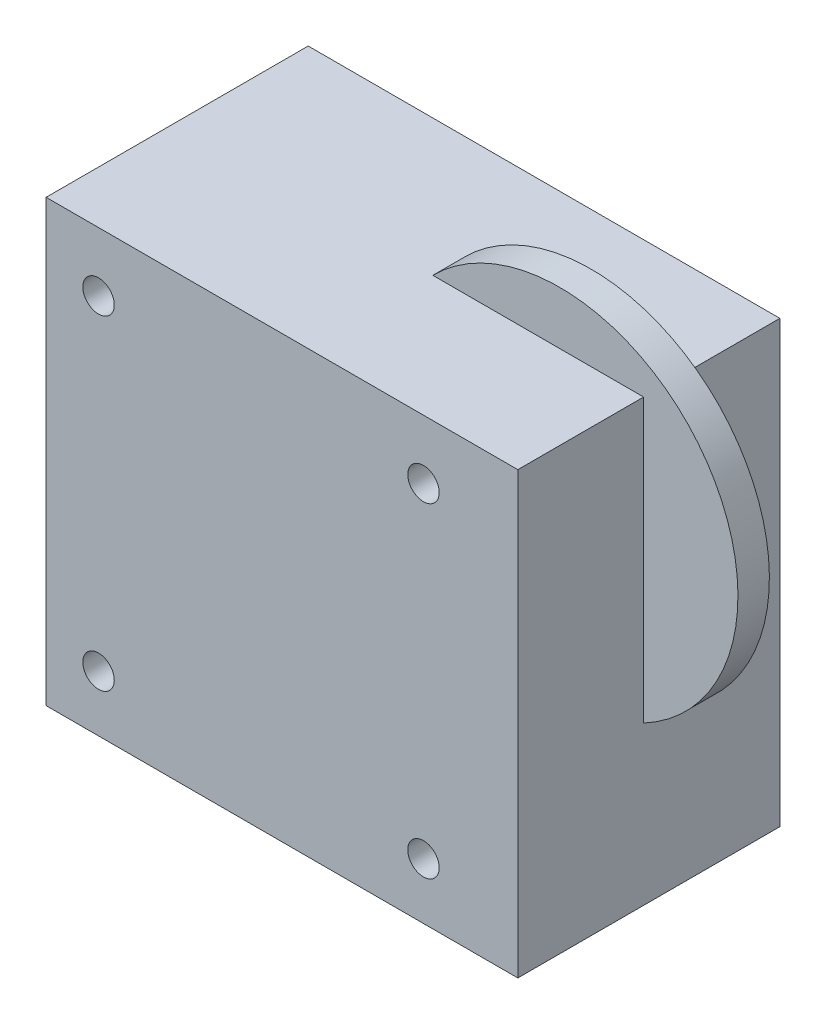
ISO-10303-21;
HEADER;
FILE_DESCRIPTION(('STEP AP214'),'2;1');
FILE_NAME('part.step','',(''),(''),'','','');
FILE_SCHEMA(('AUTOMOTIVE_DESIGN { 1 0 10303 214 1 1 1 1 }'));
ENDSEC;
DATA;
#1=APPLICATION_CONTEXT('core data for automotive mechanical design processes');
#2=APPLICATION_PROTOCOL_DEFINITION('international standard','automotive_design',2000,#1);
#3=PRODUCT_CONTEXT('',#1,'mechanical');
#4=PRODUCT('Part','Part','',(#3));
#5=PRODUCT_RELATED_PRODUCT_CATEGORY('part','',(#4));
#6=PRODUCT_DEFINITION_FORMATION('','',#4);
#7=PRODUCT_DEFINITION_CONTEXT('part definition',#1,'design');
#8=PRODUCT_DEFINITION('design','',#6,#7);
#9=PRODUCT_DEFINITION_SHAPE('','',#8);
#10=(LENGTH_UNIT() NAMED_UNIT(*) SI_UNIT(.MILLI.,.METRE.));
#11=(NAMED_UNIT(*) PLANE_ANGLE_UNIT() SI_UNIT($,.RADIAN.));
#12=(NAMED_UNIT(*) SI_UNIT($,.STERADIAN.) SOLID_ANGLE_UNIT());
#13=UNCERTAINTY_MEASURE_WITH_UNIT(LENGTH_MEASURE(1.E-05),#10,'distance_accuracy_value','');
#14=(GEOMETRIC_REPRESENTATION_CONTEXT(3) GLOBAL_UNCERTAINTY_ASSIGNED_CONTEXT((#13)) GLOBAL_UNIT_ASSIGNED_CONTEXT((#10,
#11,#12)) REPRESENTATION_CONTEXT('',''));
#15=CARTESIAN_POINT('',(0.,0.,0.));
#16=DIRECTION('',(0.,0.,1.));
#17=DIRECTION('',(1.,0.,0.));
#18=AXIS2_PLACEMENT_3D('',#15,#16,#17);
#19=CARTESIAN_POINT('',(13.5,15.35,0.));
#20=DIRECTION('',(0.,0.,1.));
#21=DIRECTION('',(1.,0.,0.));
#22=AXIS2_PLACEMENT_3D('',#19,#20,#21);
#23=CYLINDRICAL_SURFACE('',#22,1.5);
#24=CARTESIAN_POINT('',(13.5,15.35,0.));
#25=DIRECTION('',(0.,0.,1.));
#26=DIRECTION('',(1.,0.,0.));
#27=AXIS2_PLACEMENT_3D('',#24,#25,#26);
#28=CIRCLE('',#27,1.5);
#29=CARTESIAN_POINT('',(15.,15.35,0.));
#30=VERTEX_POINT('',#29);
#31=EDGE_CURVE('E152',#30,#30,#28,.T.);
#32=ORIENTED_EDGE('',*,*,#31,.F.);
#33=EDGE_LOOP('',(#32));
#34=FACE_BOUND('',#33,.T.);
#35=CARTESIAN_POINT('',(13.5,15.35,10.));
#36=DIRECTION('',(0.,0.,1.));
#37=DIRECTION('',(1.,0.,0.));
#38=AXIS2_PLACEMENT_3D('',#35,#36,#37);
#39=CIRCLE('',#38,1.5);
#40=CARTESIAN_POINT('',(15.,15.35,10.));
#41=VERTEX_POINT('',#40);
#42=EDGE_CURVE('E46',#41,#41,#39,.F.);
#43=ORIENTED_EDGE('',*,*,#42,.F.);
#44=EDGE_LOOP('',(#43));
#45=FACE_BOUND('',#44,.T.);
#46=ADVANCED_FACE('F37',(#34,#45),#23,.F.);
#47=CARTESIAN_POINT('',(22.5,-21.,25.));
#48=DIRECTION('',(-1.,0.,0.));
#49=DIRECTION('',(0.,0.,1.));
#50=AXIS2_PLACEMENT_3D('',#47,#48,#49);
#51=PLANE('',#50);
#52=DIRECTION('',(0.,0.,-1.));
#53=VECTOR('',#52,1.);
#54=CARTESIAN_POINT('',(22.5,-5.93560826022129,13.));
#55=LINE('',#54,#53);
#56=CARTESIAN_POINT('',(22.5,-5.93560826022129,13.));
#57=VERTEX_POINT('',#56);
#58=CARTESIAN_POINT('',(22.5,-5.93560826022129,10.));
#59=VERTEX_POINT('',#58);
#60=EDGE_CURVE('E53',#57,#59,#55,.T.);
#61=ORIENTED_EDGE('',*,*,#60,.F.);
#62=DIRECTION('',(0.,1.,0.));
#63=VECTOR('',#62,1.);
#64=CARTESIAN_POINT('',(22.5,-21.,13.));
#65=LINE('',#64,#63);
#66=CARTESIAN_POINT('',(22.5,21.,13.));
#67=VERTEX_POINT('',#66);
#68=EDGE_CURVE('E122',#57,#67,#65,.T.);
#69=ORIENTED_EDGE('',*,*,#68,.T.);
#70=DIRECTION('',(0.,0.,-1.));
#71=VECTOR('',#70,1.);
#72=CARTESIAN_POINT('',(22.5,21.,25.));
#73=LINE('',#72,#71);
#74=CARTESIAN_POINT('',(22.5,21.,25.));
#75=VERTEX_POINT('',#74);
#76=EDGE_CURVE('E198',#75,#67,#73,.T.);
#77=ORIENTED_EDGE('',*,*,#76,.F.);
#78=DIRECTION('',(0.,1.,0.));
#79=VECTOR('',#78,1.);
#80=CARTESIAN_POINT('',(22.5,-21.,25.));
#81=LINE('',#80,#79);
#82=CARTESIAN_POINT('',(22.5,-21.,25.));
#83=VERTEX_POINT('',#82);
#84=EDGE_CURVE('E160',#83,#75,#81,.T.);
#85=ORIENTED_EDGE('',*,*,#84,.F.);
#86=DIRECTION('',(0.,0.,-1.));
#87=VECTOR('',#86,1.);
#88=CARTESIAN_POINT('',(22.5,-21.,25.));
#89=LINE('',#88,#87);
#90=CARTESIAN_POINT('',(22.5,-21.,0.));
#91=VERTEX_POINT('',#90);
#92=EDGE_CURVE('E174',#83,#91,#89,.T.);
#93=ORIENTED_EDGE('',*,*,#92,.T.);
#94=DIRECTION('',(0.,1.,0.));
#95=VECTOR('',#94,1.);
#96=CARTESIAN_POINT('',(22.5,-21.,0.));
#97=LINE('',#96,#95);
#98=CARTESIAN_POINT('',(22.5,21.,0.));
#99=VERTEX_POINT('',#98);
#100=EDGE_CURVE('E156',#91,#99,#97,.T.);
#101=ORIENTED_EDGE('',*,*,#100,.T.);
#102=CARTESIAN_POINT('',(22.5,21.,10.));
#103=VERTEX_POINT('',#102);
#104=EDGE_CURVE('E197',#103,#99,#73,.T.);
#105=ORIENTED_EDGE('',*,*,#104,.F.);
#106=DIRECTION('',(0.,1.,0.));
#107=VECTOR('',#106,1.);
#108=CARTESIAN_POINT('',(22.5,-21.,10.));
#109=LINE('',#108,#107);
#110=EDGE_CURVE('E58',#59,#103,#109,.T.);
#111=ORIENTED_EDGE('',*,*,#110,.F.);
#112=EDGE_LOOP('',(#61,#69,#77,#85,#93,#101,#105,#111));
#113=FACE_BOUND('',#112,.T.);
#114=ADVANCED_FACE('F39',(#113),#51,.F.);
#115=CARTESIAN_POINT('',(-22.5,21.,25.));
#116=DIRECTION('',(0.,-1.,0.));
#117=DIRECTION('',(0.,0.,-1.));
#118=AXIS2_PLACEMENT_3D('',#115,#116,#117);
#119=PLANE('',#118);
#120=ORIENTED_EDGE('',*,*,#76,.T.);
#121=DIRECTION('',(-1.,0.,0.));
#122=VECTOR('',#121,1.);
#123=CARTESIAN_POINT('',(-22.5,21.,13.));
#124=LINE('',#123,#122);
#125=CARTESIAN_POINT('',(2.3945774357713,21.,13.));
#126=VERTEX_POINT('',#125);
#127=EDGE_CURVE('E99',#67,#126,#124,.T.);
#128=ORIENTED_EDGE('',*,*,#127,.T.);
#129=DIRECTION('',(0.,0.,-1.));
#130=VECTOR('',#129,1.);
#131=CARTESIAN_POINT('',(2.3945774357713,21.,13.));
#132=LINE('',#131,#130);
#133=CARTESIAN_POINT('',(2.3945774357713,21.,10.));
#134=VERTEX_POINT('',#133);
#135=EDGE_CURVE('E11',#134,#126,#132,.F.);
#136=ORIENTED_EDGE('',*,*,#135,.F.);
#137=DIRECTION('',(-1.,0.,0.));
#138=VECTOR('',#137,1.);
#139=CARTESIAN_POINT('',(-22.5,21.,10.));
#140=LINE('',#139,#138);
#141=EDGE_CURVE('E97',#103,#134,#140,.T.);
#142=ORIENTED_EDGE('',*,*,#141,.F.);
#143=ORIENTED_EDGE('',*,*,#104,.T.);
#144=DIRECTION('',(-1.,0.,0.));
#145=VECTOR('',#144,1.);
#146=CARTESIAN_POINT('',(-22.5,21.,0.));
#147=LINE('',#146,#145);
#148=CARTESIAN_POINT('',(-22.5,21.,0.));
#149=VERTEX_POINT('',#148);
#150=EDGE_CURVE('E178',#99,#149,#147,.T.);
#151=ORIENTED_EDGE('',*,*,#150,.T.);
#152=DIRECTION('',(0.,0.,-1.));
#153=VECTOR('',#152,1.);
#154=CARTESIAN_POINT('',(-22.5,21.,25.));
#155=LINE('',#154,#153);
#156=CARTESIAN_POINT('',(-22.5,21.,25.));
#157=VERTEX_POINT('',#156);
#158=EDGE_CURVE('E193',#157,#149,#155,.T.);
#159=ORIENTED_EDGE('',*,*,#158,.F.);
#160=DIRECTION('',(-1.,0.,0.));
#161=VECTOR('',#160,1.);
#162=CARTESIAN_POINT('',(-22.5,21.,25.));
#163=LINE('',#162,#161);
#164=EDGE_CURVE('E164',#75,#157,#163,.T.);
#165=ORIENTED_EDGE('',*,*,#164,.F.);
#166=EDGE_LOOP('',(#120,#128,#136,#142,#143,#151,#159,#165));
#167=FACE_BOUND('',#166,.T.);
#168=ADVANCED_FACE('F96',(#167),#119,.F.);
#169=CARTESIAN_POINT('',(-22.5,-21.,25.));
#170=DIRECTION('',(1.,0.,0.));
#171=DIRECTION('',(0.,0.,-1.));
#172=AXIS2_PLACEMENT_3D('',#169,#170,#171);
#173=PLANE('',#172);
#174=DIRECTION('',(0.,-1.,0.));
#175=VECTOR('',#174,1.);
#176=CARTESIAN_POINT('',(-22.5,-21.,0.));
#177=LINE('',#176,#175);
#178=CARTESIAN_POINT('',(-22.5,-21.,0.));
#179=VERTEX_POINT('',#178);
#180=EDGE_CURVE('E181',#149,#179,#177,.T.);
#181=ORIENTED_EDGE('',*,*,#180,.T.);
#182=DIRECTION('',(0.,0.,-1.));
#183=VECTOR('',#182,1.);
#184=CARTESIAN_POINT('',(-22.5,-21.,25.));
#185=LINE('',#184,#183);
#186=CARTESIAN_POINT('',(-22.5,-21.,25.));
#187=VERTEX_POINT('',#186);
#188=EDGE_CURVE('E189',#187,#179,#185,.T.);
#189=ORIENTED_EDGE('',*,*,#188,.F.);
#190=DIRECTION('',(0.,-1.,0.));
#191=VECTOR('',#190,1.);
#192=CARTESIAN_POINT('',(-22.5,-21.,25.));
#193=LINE('',#192,#191);
#194=EDGE_CURVE('E168',#157,#187,#193,.T.);
#195=ORIENTED_EDGE('',*,*,#194,.F.);
#196=ORIENTED_EDGE('',*,*,#158,.T.);
#197=EDGE_LOOP('',(#181,#189,#195,#196));
#198=FACE_BOUND('',#197,.T.);
#199=ADVANCED_FACE('F257',(#198),#173,.F.);
#200=CARTESIAN_POINT('',(-22.5,-21.,25.));
#201=DIRECTION('',(0.,1.,0.));
#202=DIRECTION('',(0.,0.,1.));
#203=AXIS2_PLACEMENT_3D('',#200,#201,#202);
#204=PLANE('',#203);
#205=DIRECTION('',(1.,0.,0.));
#206=VECTOR('',#205,1.);
#207=CARTESIAN_POINT('',(-22.5,-21.,0.));
#208=LINE('',#207,#206);
#209=EDGE_CURVE('E165',#179,#91,#208,.T.);
#210=ORIENTED_EDGE('',*,*,#209,.T.);
#211=ORIENTED_EDGE('',*,*,#92,.F.);
#212=DIRECTION('',(1.,0.,0.));
#213=VECTOR('',#212,1.);
#214=CARTESIAN_POINT('',(-22.5,-21.,25.));
#215=LINE('',#214,#213);
#216=EDGE_CURVE('E171',#187,#83,#215,.T.);
#217=ORIENTED_EDGE('',*,*,#216,.F.);
#218=ORIENTED_EDGE('',*,*,#188,.T.);
#219=EDGE_LOOP('',(#210,#211,#217,#218));
#220=FACE_BOUND('',#219,.T.);
#221=ADVANCED_FACE('F251',(#220),#204,.F.);
#222=CARTESIAN_POINT('',(0.,0.,25.));
#223=DIRECTION('',(0.,0.,-1.));
#224=DIRECTION('',(-1.,0.,0.));
#225=AXIS2_PLACEMENT_3D('',#222,#223,#224);
#226=PLANE('',#225);
#227=CARTESIAN_POINT('',(13.5,-15.65,25.));
#228=DIRECTION('',(0.,0.,1.));
#229=DIRECTION('',(1.,0.,0.));
#230=AXIS2_PLACEMENT_3D('',#227,#228,#229);
#231=CIRCLE('',#230,1.5);
#232=CARTESIAN_POINT('',(15.,-15.65,25.));
#233=VERTEX_POINT('',#232);
#234=EDGE_CURVE('E127',#233,#233,#231,.T.);
#235=ORIENTED_EDGE('',*,*,#234,.F.);
#236=EDGE_LOOP('',(#235));
#237=FACE_BOUND('',#236,.T.);
#238=CARTESIAN_POINT('',(-17.5,-15.65,25.));
#239=DIRECTION('',(0.,0.,1.));
#240=DIRECTION('',(1.,0.,0.));
#241=AXIS2_PLACEMENT_3D('',#238,#239,#240);
#242=CIRCLE('',#241,1.5);
#243=CARTESIAN_POINT('',(-16.,-15.65,25.));
#244=VERTEX_POINT('',#243);
#245=EDGE_CURVE('E141',#244,#244,#242,.T.);
#246=ORIENTED_EDGE('',*,*,#245,.F.);
#247=EDGE_LOOP('',(#246));
#248=FACE_BOUND('',#247,.T.);
#249=CARTESIAN_POINT('',(-17.5,15.35,25.));
#250=DIRECTION('',(0.,0.,1.));
#251=DIRECTION('',(1.,0.,0.));
#252=AXIS2_PLACEMENT_3D('',#249,#250,#251);
#253=CIRCLE('',#252,1.5);
#254=CARTESIAN_POINT('',(-16.,15.35,25.));
#255=VERTEX_POINT('',#254);
#256=EDGE_CURVE('E133',#255,#255,#253,.T.);
#257=ORIENTED_EDGE('',*,*,#256,.F.);
#258=EDGE_LOOP('',(#257));
#259=FACE_BOUND('',#258,.T.);
#260=CARTESIAN_POINT('',(13.5,15.35,25.));
#261=DIRECTION('',(0.,0.,1.));
#262=DIRECTION('',(1.,0.,0.));
#263=AXIS2_PLACEMENT_3D('',#260,#261,#262);
#264=CIRCLE('',#263,1.5);
#265=CARTESIAN_POINT('',(15.,15.35,25.));
#266=VERTEX_POINT('',#265);
#267=EDGE_CURVE('E132',#266,#266,#264,.T.);
#268=ORIENTED_EDGE('',*,*,#267,.F.);
#269=EDGE_LOOP('',(#268));
#270=FACE_BOUND('',#269,.T.);
#271=ORIENTED_EDGE('',*,*,#84,.T.);
#272=ORIENTED_EDGE('',*,*,#164,.T.);
#273=ORIENTED_EDGE('',*,*,#194,.T.);
#274=ORIENTED_EDGE('',*,*,#216,.T.);
#275=EDGE_LOOP('',(#271,#272,#273,#274));
#276=FACE_BOUND('',#275,.T.);
#277=ADVANCED_FACE('F245',(#237,#248,#259,#270,#276),#226,.F.);
#278=CARTESIAN_POINT('',(0.,0.,0.));
#279=DIRECTION('',(0.,0.,-1.));
#280=DIRECTION('',(-1.,0.,0.));
#281=AXIS2_PLACEMENT_3D('',#278,#279,#280);
#282=PLANE('',#281);
#283=CARTESIAN_POINT('',(13.5,-15.65,0.));
#284=DIRECTION('',(0.,0.,1.));
#285=DIRECTION('',(1.,0.,0.));
#286=AXIS2_PLACEMENT_3D('',#283,#284,#285);
#287=CIRCLE('',#286,1.5);
#288=CARTESIAN_POINT('',(15.,-15.65,0.));
#289=VERTEX_POINT('',#288);
#290=EDGE_CURVE('E145',#289,#289,#287,.T.);
#291=ORIENTED_EDGE('',*,*,#290,.T.);
#292=EDGE_LOOP('',(#291));
#293=FACE_BOUND('',#292,.T.);
#294=CARTESIAN_POINT('',(-17.5,-15.65,0.));
#295=DIRECTION('',(0.,0.,1.));
#296=DIRECTION('',(1.,0.,0.));
#297=AXIS2_PLACEMENT_3D('',#294,#295,#296);
#298=CIRCLE('',#297,1.5);
#299=CARTESIAN_POINT('',(-16.,-15.65,0.));
#300=VERTEX_POINT('',#299);
#301=EDGE_CURVE('E137',#300,#300,#298,.T.);
#302=ORIENTED_EDGE('',*,*,#301,.T.);
#303=EDGE_LOOP('',(#302));
#304=FACE_BOUND('',#303,.T.);
#305=CARTESIAN_POINT('',(-17.5,15.35,0.));
#306=DIRECTION('',(0.,0.,1.));
#307=DIRECTION('',(1.,0.,0.));
#308=AXIS2_PLACEMENT_3D('',#305,#306,#307);
#309=CIRCLE('',#308,1.5);
#310=CARTESIAN_POINT('',(-16.,15.35,0.));
#311=VERTEX_POINT('',#310);
#312=EDGE_CURVE('E128',#311,#311,#309,.T.);
#313=ORIENTED_EDGE('',*,*,#312,.T.);
#314=EDGE_LOOP('',(#313));
#315=FACE_BOUND('',#314,.T.);
#316=ORIENTED_EDGE('',*,*,#31,.T.);
#317=EDGE_LOOP('',(#316));
#318=FACE_BOUND('',#317,.T.);
#319=ORIENTED_EDGE('',*,*,#100,.F.);
#320=ORIENTED_EDGE('',*,*,#209,.F.);
#321=ORIENTED_EDGE('',*,*,#180,.F.);
#322=ORIENTED_EDGE('',*,*,#150,.F.);
#323=EDGE_LOOP('',(#319,#320,#321,#322));
#324=FACE_BOUND('',#323,.T.);
#325=ADVANCED_FACE('F237',(#293,#304,#315,#318,#324),#282,.T.);
#326=CARTESIAN_POINT('',(13.5,15.35,13.));
#327=DIRECTION('',(0.,0.,1.));
#328=DIRECTION('',(1.,0.,0.));
#329=AXIS2_PLACEMENT_3D('',#326,#327,#328);
#330=CIRCLE('',#329,1.5);
#331=CARTESIAN_POINT('',(15.,15.35,13.));
#332=VERTEX_POINT('',#331);
#333=EDGE_CURVE('E119',#332,#332,#330,.F.);
#334=ORIENTED_EDGE('',*,*,#333,.T.);
#335=EDGE_LOOP('',(#334));
#336=FACE_BOUND('',#335,.T.);
#337=ORIENTED_EDGE('',*,*,#267,.T.);
#338=EDGE_LOOP('',(#337));
#339=FACE_BOUND('',#338,.T.);
#340=ADVANCED_FACE('F207',(#336,#339),#23,.F.);
#341=CARTESIAN_POINT('',(-17.5,15.35,0.));
#342=DIRECTION('',(0.,0.,1.));
#343=DIRECTION('',(1.,0.,0.));
#344=AXIS2_PLACEMENT_3D('',#341,#342,#343);
#345=CYLINDRICAL_SURFACE('',#344,1.5);
#346=ORIENTED_EDGE('',*,*,#312,.F.);
#347=EDGE_LOOP('',(#346));
#348=FACE_BOUND('',#347,.T.);
#349=ORIENTED_EDGE('',*,*,#256,.T.);
#350=EDGE_LOOP('',(#349));
#351=FACE_BOUND('',#350,.T.);
#352=ADVANCED_FACE('F236',(#348,#351),#345,.F.);
#353=CARTESIAN_POINT('',(-17.5,-15.65,0.));
#354=DIRECTION('',(0.,0.,1.));
#355=DIRECTION('',(1.,0.,0.));
#356=AXIS2_PLACEMENT_3D('',#353,#354,#355);
#357=CYLINDRICAL_SURFACE('',#356,1.5);
#358=ORIENTED_EDGE('',*,*,#301,.F.);
#359=EDGE_LOOP('',(#358));
#360=FACE_BOUND('',#359,.T.);
#361=ORIENTED_EDGE('',*,*,#245,.T.);
#362=EDGE_LOOP('',(#361));
#363=FACE_BOUND('',#362,.T.);
#364=ADVANCED_FACE('F242',(#360,#363),#357,.F.);
#365=CARTESIAN_POINT('',(13.5,-15.65,0.));
#366=DIRECTION('',(0.,0.,1.));
#367=DIRECTION('',(1.,0.,0.));
#368=AXIS2_PLACEMENT_3D('',#365,#366,#367);
#369=CYLINDRICAL_SURFACE('',#368,1.5);
#370=ORIENTED_EDGE('',*,*,#290,.F.);
#371=EDGE_LOOP('',(#370));
#372=FACE_BOUND('',#371,.T.);
#373=ORIENTED_EDGE('',*,*,#234,.T.);
#374=EDGE_LOOP('',(#373));
#375=FACE_BOUND('',#374,.T.);
#376=ADVANCED_FACE('F220',(#372,#375),#369,.F.);
#377=CARTESIAN_POINT('',(14.5,9.06439173977871,10.));
#378=DIRECTION('',(0.,0.,1.));
#379=DIRECTION('',(1.,0.,0.));
#380=AXIS2_PLACEMENT_3D('',#377,#378,#379);
#381=PLANE('',#380);
#382=ORIENTED_EDGE('',*,*,#42,.T.);
#383=EDGE_LOOP('',(#382));
#384=FACE_BOUND('',#383,.T.);
#385=ADVANCED_FACE('F212',(#384),#381,.F.);
#386=CARTESIAN_POINT('',(14.5,9.06439173977871,13.));
#387=DIRECTION('',(0.,0.,1.));
#388=DIRECTION('',(1.,0.,0.));
#389=AXIS2_PLACEMENT_3D('',#386,#387,#388);
#390=PLANE('',#389);
#391=ORIENTED_EDGE('',*,*,#333,.F.);
#392=EDGE_LOOP('',(#391));
#393=FACE_BOUND('',#392,.T.);
#394=ADVANCED_FACE('F210',(#393),#390,.T.);
#395=CARTESIAN_POINT('',(14.5,9.06439173977871,13.));
#396=DIRECTION('',(0.,0.,-1.));
#397=DIRECTION('',(-1.,0.,0.));
#398=AXIS2_PLACEMENT_3D('',#395,#396,#397);
#399=CYLINDRICAL_SURFACE('',#398,17.);
#400=CARTESIAN_POINT('',(14.5,9.06439173977871,13.));
#401=DIRECTION('',(0.,0.,1.));
#402=DIRECTION('',(1.,0.,0.));
#403=AXIS2_PLACEMENT_3D('',#400,#401,#402);
#404=CIRCLE('',#403,17.);
#405=EDGE_CURVE('E109',#57,#126,#404,.T.);
#406=ORIENTED_EDGE('',*,*,#405,.F.);
#407=ORIENTED_EDGE('',*,*,#60,.T.);
#408=CARTESIAN_POINT('',(14.5,9.06439173977871,10.));
#409=DIRECTION('',(0.,0.,1.));
#410=DIRECTION('',(1.,0.,0.));
#411=AXIS2_PLACEMENT_3D('',#408,#409,#410);
#412=CIRCLE('',#411,17.);
#413=EDGE_CURVE('E107',#59,#134,#412,.T.);
#414=ORIENTED_EDGE('',*,*,#413,.T.);
#415=ORIENTED_EDGE('',*,*,#135,.T.);
#416=EDGE_LOOP('',(#406,#407,#414,#415));
#417=FACE_BOUND('',#416,.T.);
#418=ADVANCED_FACE('F111',(#417),#399,.T.);
#419=ORIENTED_EDGE('',*,*,#68,.F.);
#420=ORIENTED_EDGE('',*,*,#405,.T.);
#421=ORIENTED_EDGE('',*,*,#127,.F.);
#422=EDGE_LOOP('',(#419,#420,#421));
#423=FACE_BOUND('',#422,.T.);
#424=ADVANCED_FACE('F214',(#423),#390,.T.);
#425=ORIENTED_EDGE('',*,*,#413,.F.);
#426=ORIENTED_EDGE('',*,*,#110,.T.);
#427=ORIENTED_EDGE('',*,*,#141,.T.);
#428=EDGE_LOOP('',(#425,#426,#427));
#429=FACE_BOUND('',#428,.T.);
#430=ADVANCED_FACE('F106',(#429),#381,.F.);
#431=CLOSED_SHELL('',(#46,#114,#168,#199,#221,#277,#325,#340,#352,#364,#376,#385,#394,#418,#424,#430));
#432=MANIFOLD_SOLID_BREP('B2',#431);
#433=ADVANCED_BREP_SHAPE_REPRESENTATION('',(#18,#432),#14);
#434=SHAPE_DEFINITION_REPRESENTATION(#9,#433);
ENDSEC;
END-ISO-10303-21;
